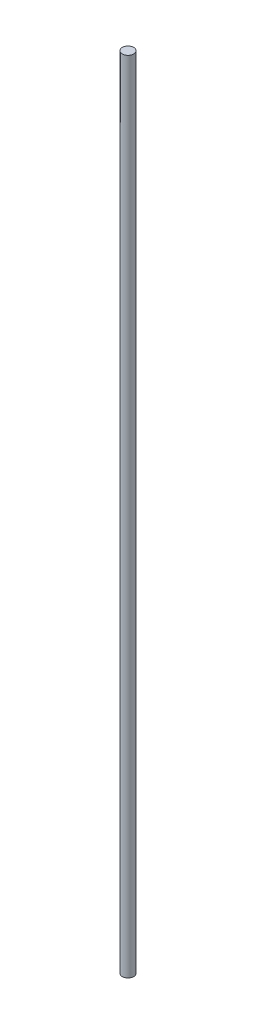
ISO-10303-21;
HEADER;
FILE_DESCRIPTION(('STEP AP214'),'2;1');
FILE_NAME('part.step','',(''),(''),'','','');
FILE_SCHEMA(('AUTOMOTIVE_DESIGN { 1 0 10303 214 1 1 1 1 }'));
ENDSEC;
DATA;
#1=APPLICATION_CONTEXT('core data for automotive mechanical design processes');
#2=APPLICATION_PROTOCOL_DEFINITION('international standard','automotive_design',2000,#1);
#3=PRODUCT_CONTEXT('',#1,'mechanical');
#4=PRODUCT('Part','Part','',(#3));
#5=PRODUCT_RELATED_PRODUCT_CATEGORY('part','',(#4));
#6=PRODUCT_DEFINITION_FORMATION('','',#4);
#7=PRODUCT_DEFINITION_CONTEXT('part definition',#1,'design');
#8=PRODUCT_DEFINITION('design','',#6,#7);
#9=PRODUCT_DEFINITION_SHAPE('','',#8);
#10=(LENGTH_UNIT() NAMED_UNIT(*) SI_UNIT(.MILLI.,.METRE.));
#11=(NAMED_UNIT(*) PLANE_ANGLE_UNIT() SI_UNIT($,.RADIAN.));
#12=(NAMED_UNIT(*) SI_UNIT($,.STERADIAN.) SOLID_ANGLE_UNIT());
#13=UNCERTAINTY_MEASURE_WITH_UNIT(LENGTH_MEASURE(1.E-05),#10,'distance_accuracy_value','');
#14=(GEOMETRIC_REPRESENTATION_CONTEXT(3) GLOBAL_UNCERTAINTY_ASSIGNED_CONTEXT((#13)) GLOBAL_UNIT_ASSIGNED_CONTEXT((#10,
#11,#12)) REPRESENTATION_CONTEXT('',''));
#15=CARTESIAN_POINT('',(0.,0.,0.));
#16=DIRECTION('',(0.,0.,1.));
#17=DIRECTION('',(1.,0.,0.));
#18=AXIS2_PLACEMENT_3D('',#15,#16,#17);
#19=CARTESIAN_POINT('',(0.,1750.,0.));
#20=DIRECTION('',(0.,-1.,0.));
#21=DIRECTION('',(0.,0.,-1.));
#22=AXIS2_PLACEMENT_3D('',#19,#20,#21);
#23=CYLINDRICAL_SURFACE('',#22,12.5);
#24=CARTESIAN_POINT('',(0.,1750.,0.));
#25=DIRECTION('',(0.,1.,0.));
#26=DIRECTION('',(0.,0.,1.));
#27=AXIS2_PLACEMENT_3D('',#24,#25,#26);
#28=CIRCLE('',#27,12.5);
#29=CARTESIAN_POINT('',(0.,1750.,12.5));
#30=VERTEX_POINT('',#29);
#31=EDGE_CURVE('E10',#30,#30,#28,.T.);
#32=ORIENTED_EDGE('',*,*,#31,.F.);
#33=EDGE_LOOP('',(#32));
#34=FACE_BOUND('',#33,.T.);
#35=CARTESIAN_POINT('',(0.,0.,0.));
#36=DIRECTION('',(0.,1.,0.));
#37=DIRECTION('',(0.,0.,1.));
#38=AXIS2_PLACEMENT_3D('',#35,#36,#37);
#39=CIRCLE('',#38,12.5);
#40=CARTESIAN_POINT('',(0.,0.,12.5));
#41=VERTEX_POINT('',#40);
#42=EDGE_CURVE('E38',#41,#41,#39,.T.);
#43=ORIENTED_EDGE('',*,*,#42,.T.);
#44=EDGE_LOOP('',(#43));
#45=FACE_BOUND('',#44,.T.);
#46=ADVANCED_FACE('F35',(#34,#45),#23,.T.);
#47=CARTESIAN_POINT('',(0.,1750.,0.));
#48=DIRECTION('',(0.,1.,0.));
#49=DIRECTION('',(0.,0.,1.));
#50=AXIS2_PLACEMENT_3D('',#47,#48,#49);
#51=PLANE('',#50);
#52=ORIENTED_EDGE('',*,*,#31,.T.);
#53=EDGE_LOOP('',(#52));
#54=FACE_BOUND('',#53,.T.);
#55=ADVANCED_FACE('F50',(#54),#51,.T.);
#56=CARTESIAN_POINT('',(0.,0.,0.));
#57=DIRECTION('',(0.,1.,0.));
#58=DIRECTION('',(0.,0.,1.));
#59=AXIS2_PLACEMENT_3D('',#56,#57,#58);
#60=PLANE('',#59);
#61=ORIENTED_EDGE('',*,*,#42,.F.);
#62=EDGE_LOOP('',(#61));
#63=FACE_BOUND('',#62,.T.);
#64=ADVANCED_FACE('F48',(#63),#60,.F.);
#65=CLOSED_SHELL('',(#46,#55,#64));
#66=MANIFOLD_SOLID_BREP('B2',#65);
#67=ADVANCED_BREP_SHAPE_REPRESENTATION('',(#18,#66),#14);
#68=SHAPE_DEFINITION_REPRESENTATION(#9,#67);
ENDSEC;
END-ISO-10303-21;
